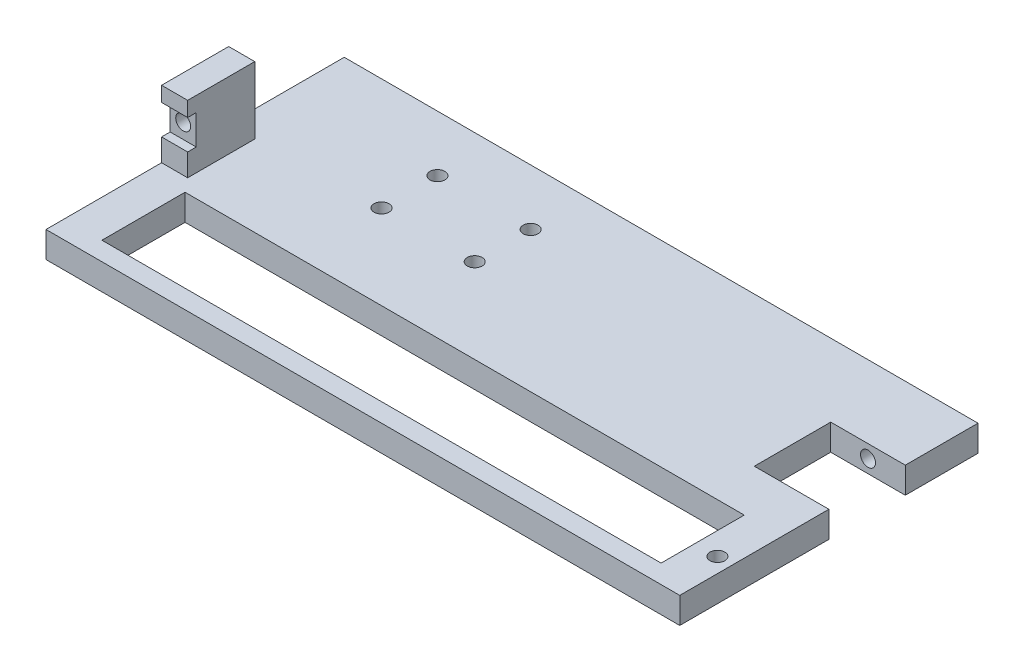
ISO-10303-21;
HEADER;
FILE_DESCRIPTION(('STEP AP214'),'2;1');
FILE_NAME('part.step','',(''),(''),'','','');
FILE_SCHEMA(('AUTOMOTIVE_DESIGN { 1 0 10303 214 1 1 1 1 }'));
ENDSEC;
DATA;
#1=APPLICATION_CONTEXT('core data for automotive mechanical design processes');
#2=APPLICATION_PROTOCOL_DEFINITION('international standard','automotive_design',2000,#1);
#3=PRODUCT_CONTEXT('',#1,'mechanical');
#4=PRODUCT('Part','Part','',(#3));
#5=PRODUCT_RELATED_PRODUCT_CATEGORY('part','',(#4));
#6=PRODUCT_DEFINITION_FORMATION('','',#4);
#7=PRODUCT_DEFINITION_CONTEXT('part definition',#1,'design');
#8=PRODUCT_DEFINITION('design','',#6,#7);
#9=PRODUCT_DEFINITION_SHAPE('','',#8);
#10=(LENGTH_UNIT() NAMED_UNIT(*) SI_UNIT(.MILLI.,.METRE.));
#11=(NAMED_UNIT(*) PLANE_ANGLE_UNIT() SI_UNIT($,.RADIAN.));
#12=(NAMED_UNIT(*) SI_UNIT($,.STERADIAN.) SOLID_ANGLE_UNIT());
#13=UNCERTAINTY_MEASURE_WITH_UNIT(LENGTH_MEASURE(1.E-05),#10,'distance_accuracy_value','');
#14=(GEOMETRIC_REPRESENTATION_CONTEXT(3) GLOBAL_UNCERTAINTY_ASSIGNED_CONTEXT((#13)) GLOBAL_UNIT_ASSIGNED_CONTEXT((#10,
#11,#12)) REPRESENTATION_CONTEXT('',''));
#15=CARTESIAN_POINT('',(0.,0.,0.));
#16=DIRECTION('',(0.,0.,1.));
#17=DIRECTION('',(1.,0.,0.));
#18=AXIS2_PLACEMENT_3D('',#15,#16,#17);
#19=CARTESIAN_POINT('',(90.1703163017032,7.,-39.7080291970803));
#20=DIRECTION('',(-1.,0.,0.));
#21=DIRECTION('',(0.,0.,1.));
#22=AXIS2_PLACEMENT_3D('',#19,#20,#21);
#23=PLANE('',#22);
#24=DIRECTION('',(0.,0.,-1.));
#25=VECTOR('',#24,1.);
#26=CARTESIAN_POINT('',(90.1703163017032,7.,-39.7080291970803));
#27=LINE('',#26,#25);
#28=CARTESIAN_POINT('',(90.1703163017032,7.,-20.2080291970803));
#29=VERTEX_POINT('',#28);
#30=CARTESIAN_POINT('',(90.1703163017032,7.,-39.7080291970803));
#31=VERTEX_POINT('',#30);
#32=EDGE_CURVE('E289',#29,#31,#27,.T.);
#33=ORIENTED_EDGE('',*,*,#32,.F.);
#34=DIRECTION('',(0.,1.,0.));
#35=VECTOR('',#34,1.);
#36=CARTESIAN_POINT('',(90.1703163017032,-4.,-20.2080291970803));
#37=LINE('',#36,#35);
#38=CARTESIAN_POINT('',(90.1703163017032,0.,-20.2080291970803));
#39=VERTEX_POINT('',#38);
#40=EDGE_CURVE('E201',#39,#29,#37,.T.);
#41=ORIENTED_EDGE('',*,*,#40,.F.);
#42=DIRECTION('',(0.,0.,-1.));
#43=VECTOR('',#42,1.);
#44=CARTESIAN_POINT('',(90.1703163017032,0.,-39.7080291970803));
#45=LINE('',#44,#43);
#46=CARTESIAN_POINT('',(90.1703163017032,0.,-39.7080291970803));
#47=VERTEX_POINT('',#46);
#48=EDGE_CURVE('E298',#39,#47,#45,.T.);
#49=ORIENTED_EDGE('',*,*,#48,.T.);
#50=DIRECTION('',(0.,-1.,0.));
#51=VECTOR('',#50,1.);
#52=CARTESIAN_POINT('',(90.1703163017032,7.,-39.7080291970803));
#53=LINE('',#52,#51);
#54=EDGE_CURVE('E306',#31,#47,#53,.T.);
#55=ORIENTED_EDGE('',*,*,#54,.F.);
#56=EDGE_LOOP('',(#33,#41,#49,#55));
#57=FACE_BOUND('',#56,.T.);
#58=ADVANCED_FACE('F32',(#57),#23,.F.);
#59=CARTESIAN_POINT('',(-79.8296836982968,25.,9.29197080291969));
#60=DIRECTION('',(0.,0.,-1.));
#61=DIRECTION('',(-1.,0.,0.));
#62=AXIS2_PLACEMENT_3D('',#59,#60,#61);
#63=PLANE('',#62);
#64=DIRECTION('',(0.,-1.,0.));
#65=VECTOR('',#64,1.);
#66=CARTESIAN_POINT('',(-79.8296836982968,25.,9.29197080291969));
#67=LINE('',#66,#65);
#68=CARTESIAN_POINT('',(-79.8296836982968,25.,9.29197080291969));
#69=VERTEX_POINT('',#68);
#70=CARTESIAN_POINT('',(-79.8296836982968,21.,9.29197080291969));
#71=VERTEX_POINT('',#70);
#72=EDGE_CURVE('E280',#69,#71,#67,.T.);
#73=ORIENTED_EDGE('',*,*,#72,.T.);
#74=DIRECTION('',(-1.,0.,0.));
#75=VECTOR('',#74,1.);
#76=CARTESIAN_POINT('',(-79.8296836982968,21.,9.29197080291969));
#77=LINE('',#76,#75);
#78=CARTESIAN_POINT('',(-72.8296836982968,21.,9.29197080291969));
#79=VERTEX_POINT('',#78);
#80=EDGE_CURVE('E228',#79,#71,#77,.T.);
#81=ORIENTED_EDGE('',*,*,#80,.F.);
#82=DIRECTION('',(0.,-1.,0.));
#83=VECTOR('',#82,1.);
#84=CARTESIAN_POINT('',(-72.8296836982968,25.,9.29197080291969));
#85=LINE('',#84,#83);
#86=CARTESIAN_POINT('',(-72.8296836982968,25.,9.29197080291969));
#87=VERTEX_POINT('',#86);
#88=EDGE_CURVE('E276',#87,#79,#85,.T.);
#89=ORIENTED_EDGE('',*,*,#88,.F.);
#90=DIRECTION('',(1.,0.,0.));
#91=VECTOR('',#90,1.);
#92=CARTESIAN_POINT('',(-79.8296836982968,25.,9.29197080291969));
#93=LINE('',#92,#91);
#94=EDGE_CURVE('E255',#69,#87,#93,.T.);
#95=ORIENTED_EDGE('',*,*,#94,.F.);
#96=EDGE_LOOP('',(#73,#81,#89,#95));
#97=FACE_BOUND('',#96,.T.);
#98=ADVANCED_FACE('F410',(#97),#63,.F.);
#99=CARTESIAN_POINT('',(-76.3296836982968,17.,11.2919708029197));
#100=DIRECTION('',(0.,0.,-1.));
#101=DIRECTION('',(-1.,0.,0.));
#102=AXIS2_PLACEMENT_3D('',#99,#100,#101);
#103=CYLINDRICAL_SURFACE('',#102,2.);
#104=CARTESIAN_POINT('',(-76.3296836982968,17.,-8.70802919708031));
#105=DIRECTION('',(0.,0.,-1.));
#106=DIRECTION('',(-1.,0.,0.));
#107=AXIS2_PLACEMENT_3D('',#104,#105,#106);
#108=CIRCLE('',#107,2.);
#109=CARTESIAN_POINT('',(-78.3296836982968,17.,-8.70802919708031));
#110=VERTEX_POINT('',#109);
#111=EDGE_CURVE('E248',#110,#110,#108,.T.);
#112=ORIENTED_EDGE('',*,*,#111,.T.);
#113=EDGE_LOOP('',(#112));
#114=FACE_BOUND('',#113,.T.);
#115=CARTESIAN_POINT('',(-76.3296836982968,17.,6.99197080291969));
#116=DIRECTION('',(0.,0.,1.));
#117=DIRECTION('',(1.,0.,0.));
#118=AXIS2_PLACEMENT_3D('',#115,#116,#117);
#119=CIRCLE('',#118,2.);
#120=CARTESIAN_POINT('',(-74.3296836982968,17.,6.99197080291969));
#121=VERTEX_POINT('',#120);
#122=EDGE_CURVE('E241',#121,#121,#119,.F.);
#123=ORIENTED_EDGE('',*,*,#122,.F.);
#124=EDGE_LOOP('',(#123));
#125=FACE_BOUND('',#124,.T.);
#126=ADVANCED_FACE('F416',(#114,#125),#103,.F.);
#127=CARTESIAN_POINT('',(-79.8296836982968,7.,-39.7080291970803));
#128=DIRECTION('',(1.,0.,0.));
#129=DIRECTION('',(0.,0.,-1.));
#130=AXIS2_PLACEMENT_3D('',#127,#128,#129);
#131=PLANE('',#130);
#132=DIRECTION('',(0.,-1.,0.));
#133=VECTOR('',#132,1.);
#134=CARTESIAN_POINT('',(-79.8296836982968,21.,6.99197080291969));
#135=LINE('',#134,#133);
#136=CARTESIAN_POINT('',(-79.8296836982968,21.,6.99197080291969));
#137=VERTEX_POINT('',#136);
#138=CARTESIAN_POINT('',(-79.8296836982968,13.,6.99197080291969));
#139=VERTEX_POINT('',#138);
#140=EDGE_CURVE('E224',#137,#139,#135,.T.);
#141=ORIENTED_EDGE('',*,*,#140,.F.);
#142=DIRECTION('',(0.,0.,1.));
#143=VECTOR('',#142,1.);
#144=CARTESIAN_POINT('',(-79.8296836982968,21.,6.99197080291969));
#145=LINE('',#144,#143);
#146=EDGE_CURVE('E238',#137,#71,#145,.T.);
#147=ORIENTED_EDGE('',*,*,#146,.T.);
#148=ORIENTED_EDGE('',*,*,#72,.F.);
#149=DIRECTION('',(0.,0.,1.));
#150=VECTOR('',#149,1.);
#151=CARTESIAN_POINT('',(-79.8296836982968,25.,-8.70802919708031));
#152=LINE('',#151,#150);
#153=CARTESIAN_POINT('',(-79.8296836982968,25.,-8.70802919708031));
#154=VERTEX_POINT('',#153);
#155=EDGE_CURVE('E252',#154,#69,#152,.T.);
#156=ORIENTED_EDGE('',*,*,#155,.F.);
#157=DIRECTION('',(0.,-1.,0.));
#158=VECTOR('',#157,1.);
#159=CARTESIAN_POINT('',(-79.8296836982968,25.,-8.70802919708031));
#160=LINE('',#159,#158);
#161=CARTESIAN_POINT('',(-79.8296836982968,7.,-8.70802919708031));
#162=VERTEX_POINT('',#161);
#163=EDGE_CURVE('E262',#154,#162,#160,.T.);
#164=ORIENTED_EDGE('',*,*,#163,.T.);
#165=DIRECTION('',(0.,0.,1.));
#166=VECTOR('',#165,1.);
#167=CARTESIAN_POINT('',(-79.8296836982968,7.,-39.7080291970803));
#168=LINE('',#167,#166);
#169=CARTESIAN_POINT('',(-79.8296836982968,7.,-39.7080291970803));
#170=VERTEX_POINT('',#169);
#171=EDGE_CURVE('E284',#170,#162,#168,.T.);
#172=ORIENTED_EDGE('',*,*,#171,.F.);
#173=DIRECTION('',(0.,-1.,0.));
#174=VECTOR('',#173,1.);
#175=CARTESIAN_POINT('',(-79.8296836982968,7.,-39.7080291970803));
#176=LINE('',#175,#174);
#177=CARTESIAN_POINT('',(-79.8296836982968,0.,-39.7080291970803));
#178=VERTEX_POINT('',#177);
#179=EDGE_CURVE('E293',#170,#178,#176,.T.);
#180=ORIENTED_EDGE('',*,*,#179,.T.);
#181=DIRECTION('',(0.,0.,1.));
#182=VECTOR('',#181,1.);
#183=CARTESIAN_POINT('',(-79.8296836982968,0.,-39.7080291970803));
#184=LINE('',#183,#182);
#185=CARTESIAN_POINT('',(-79.8296836982968,0.,40.2919708029197));
#186=VERTEX_POINT('',#185);
#187=EDGE_CURVE('E283',#178,#186,#184,.T.);
#188=ORIENTED_EDGE('',*,*,#187,.T.);
#189=DIRECTION('',(0.,-1.,0.));
#190=VECTOR('',#189,1.);
#191=CARTESIAN_POINT('',(-79.8296836982968,7.,40.2919708029197));
#192=LINE('',#191,#190);
#193=CARTESIAN_POINT('',(-79.8296836982968,7.,40.2919708029197));
#194=VERTEX_POINT('',#193);
#195=EDGE_CURVE('E312',#194,#186,#192,.T.);
#196=ORIENTED_EDGE('',*,*,#195,.F.);
#197=CARTESIAN_POINT('',(-79.8296836982968,7.,9.29197080291969));
#198=VERTEX_POINT('',#197);
#199=EDGE_CURVE('E287',#198,#194,#168,.T.);
#200=ORIENTED_EDGE('',*,*,#199,.F.);
#201=CARTESIAN_POINT('',(-79.8296836982968,13.,9.29197080291969));
#202=VERTEX_POINT('',#201);
#203=EDGE_CURVE('E279',#202,#198,#67,.T.);
#204=ORIENTED_EDGE('',*,*,#203,.F.);
#205=DIRECTION('',(0.,0.,1.));
#206=VECTOR('',#205,1.);
#207=CARTESIAN_POINT('',(-79.8296836982968,13.,6.99197080291969));
#208=LINE('',#207,#206);
#209=EDGE_CURVE('E235',#139,#202,#208,.T.);
#210=ORIENTED_EDGE('',*,*,#209,.F.);
#211=EDGE_LOOP('',(#141,#147,#148,#156,#164,#172,#180,#188,#196,#200,#204,#210));
#212=FACE_BOUND('',#211,.T.);
#213=ADVANCED_FACE('F34',(#212),#131,.F.);
#214=CARTESIAN_POINT('',(-79.8296836982968,7.,40.2919708029197));
#215=DIRECTION('',(0.,0.,-1.));
#216=DIRECTION('',(-1.,0.,0.));
#217=AXIS2_PLACEMENT_3D('',#214,#215,#216);
#218=PLANE('',#217);
#219=DIRECTION('',(1.,0.,0.));
#220=VECTOR('',#219,1.);
#221=CARTESIAN_POINT('',(-79.8296836982968,0.,40.2919708029197));
#222=LINE('',#221,#220);
#223=CARTESIAN_POINT('',(90.1703163017032,0.,40.2919708029197));
#224=VERTEX_POINT('',#223);
#225=EDGE_CURVE('E296',#186,#224,#222,.T.);
#226=ORIENTED_EDGE('',*,*,#225,.T.);
#227=DIRECTION('',(0.,-1.,0.));
#228=VECTOR('',#227,1.);
#229=CARTESIAN_POINT('',(90.1703163017032,7.,40.2919708029197));
#230=LINE('',#229,#228);
#231=CARTESIAN_POINT('',(90.1703163017032,7.,40.2919708029197));
#232=VERTEX_POINT('',#231);
#233=EDGE_CURVE('E309',#232,#224,#230,.T.);
#234=ORIENTED_EDGE('',*,*,#233,.F.);
#235=DIRECTION('',(1.,0.,0.));
#236=VECTOR('',#235,1.);
#237=CARTESIAN_POINT('',(-79.8296836982968,7.,40.2919708029197));
#238=LINE('',#237,#236);
#239=EDGE_CURVE('E286',#194,#232,#238,.T.);
#240=ORIENTED_EDGE('',*,*,#239,.F.);
#241=ORIENTED_EDGE('',*,*,#195,.T.);
#242=EDGE_LOOP('',(#226,#234,#240,#241));
#243=FACE_BOUND('',#242,.T.);
#244=ADVANCED_FACE('F421',(#243),#218,.F.);
#245=CARTESIAN_POINT('',(90.1703163017032,0.,0.291970802919699));
#246=VERTEX_POINT('',#245);
#247=EDGE_CURVE('E299',#224,#246,#45,.T.);
#248=ORIENTED_EDGE('',*,*,#247,.T.);
#249=DIRECTION('',(0.,1.,0.));
#250=VECTOR('',#249,1.);
#251=CARTESIAN_POINT('',(90.1703163017032,-4.,0.291970802919695));
#252=LINE('',#251,#250);
#253=CARTESIAN_POINT('',(90.1703163017032,7.,0.291970802919695));
#254=VERTEX_POINT('',#253);
#255=EDGE_CURVE('E49',#246,#254,#252,.T.);
#256=ORIENTED_EDGE('',*,*,#255,.T.);
#257=EDGE_CURVE('E194',#232,#254,#27,.T.);
#258=ORIENTED_EDGE('',*,*,#257,.F.);
#259=ORIENTED_EDGE('',*,*,#233,.T.);
#260=EDGE_LOOP('',(#248,#256,#258,#259));
#261=FACE_BOUND('',#260,.T.);
#262=ADVANCED_FACE('F412',(#261),#23,.F.);
#263=CARTESIAN_POINT('',(-79.8296836982968,7.,-39.7080291970803));
#264=DIRECTION('',(0.,0.,1.));
#265=DIRECTION('',(1.,0.,0.));
#266=AXIS2_PLACEMENT_3D('',#263,#264,#265);
#267=PLANE('',#266);
#268=CARTESIAN_POINT('',(80.1703163017032,3.5,-39.7080291970803));
#269=DIRECTION('',(0.,0.,1.));
#270=DIRECTION('',(1.,0.,0.));
#271=AXIS2_PLACEMENT_3D('',#268,#269,#270);
#272=CIRCLE('',#271,2.);
#273=CARTESIAN_POINT('',(82.1703163017032,3.5,-39.7080291970803));
#274=VERTEX_POINT('',#273);
#275=EDGE_CURVE('E188',#274,#274,#272,.T.);
#276=ORIENTED_EDGE('',*,*,#275,.T.);
#277=EDGE_LOOP('',(#276));
#278=FACE_BOUND('',#277,.T.);
#279=DIRECTION('',(-1.,0.,0.));
#280=VECTOR('',#279,1.);
#281=CARTESIAN_POINT('',(-79.8296836982968,0.,-39.7080291970803));
#282=LINE('',#281,#280);
#283=EDGE_CURVE('E302',#47,#178,#282,.T.);
#284=ORIENTED_EDGE('',*,*,#283,.T.);
#285=ORIENTED_EDGE('',*,*,#179,.F.);
#286=DIRECTION('',(-1.,0.,0.));
#287=VECTOR('',#286,1.);
#288=CARTESIAN_POINT('',(-79.8296836982968,7.,-39.7080291970803));
#289=LINE('',#288,#287);
#290=EDGE_CURVE('E291',#31,#170,#289,.T.);
#291=ORIENTED_EDGE('',*,*,#290,.F.);
#292=ORIENTED_EDGE('',*,*,#54,.T.);
#293=EDGE_LOOP('',(#284,#285,#291,#292));
#294=FACE_BOUND('',#293,.T.);
#295=ADVANCED_FACE('F390',(#278,#294),#267,.F.);
#296=CARTESIAN_POINT('',(0.,7.,0.));
#297=DIRECTION('',(0.,1.,0.));
#298=DIRECTION('',(0.,0.,1.));
#299=AXIS2_PLACEMENT_3D('',#296,#297,#298);
#300=PLANE('',#299);
#301=CARTESIAN_POINT('',(-14.8296836982968,7.,-9.70802919708031));
#302=DIRECTION('',(0.,1.,0.));
#303=DIRECTION('',(0.,0.,1.));
#304=AXIS2_PLACEMENT_3D('',#301,#302,#303);
#305=CIRCLE('',#304,2.);
#306=CARTESIAN_POINT('',(-14.8296836982968,7.,-7.70802919708031));
#307=VERTEX_POINT('',#306);
#308=EDGE_CURVE('E345',#307,#307,#305,.T.);
#309=ORIENTED_EDGE('',*,*,#308,.F.);
#310=EDGE_LOOP('',(#309));
#311=FACE_BOUND('',#310,.T.);
#312=CARTESIAN_POINT('',(-14.8296836982968,7.,-24.7080291970803));
#313=DIRECTION('',(0.,1.,0.));
#314=DIRECTION('',(0.,0.,1.));
#315=AXIS2_PLACEMENT_3D('',#312,#313,#314);
#316=CIRCLE('',#315,2.);
#317=CARTESIAN_POINT('',(-14.8296836982968,7.,-22.7080291970803));
#318=VERTEX_POINT('',#317);
#319=EDGE_CURVE('E348',#318,#318,#316,.T.);
#320=ORIENTED_EDGE('',*,*,#319,.F.);
#321=EDGE_LOOP('',(#320));
#322=FACE_BOUND('',#321,.T.);
#323=CARTESIAN_POINT('',(-39.8296836982968,7.,-24.7080291970803));
#324=DIRECTION('',(0.,1.,0.));
#325=DIRECTION('',(0.,0.,1.));
#326=AXIS2_PLACEMENT_3D('',#323,#324,#325);
#327=CIRCLE('',#326,2.);
#328=CARTESIAN_POINT('',(-39.8296836982968,7.,-22.7080291970803));
#329=VERTEX_POINT('',#328);
#330=EDGE_CURVE('E351',#329,#329,#327,.T.);
#331=ORIENTED_EDGE('',*,*,#330,.F.);
#332=EDGE_LOOP('',(#331));
#333=FACE_BOUND('',#332,.T.);
#334=CARTESIAN_POINT('',(-39.8296836982968,7.,-9.70802919708031));
#335=DIRECTION('',(0.,1.,0.));
#336=DIRECTION('',(0.,0.,1.));
#337=AXIS2_PLACEMENT_3D('',#334,#335,#336);
#338=CIRCLE('',#337,2.);
#339=CARTESIAN_POINT('',(-39.8296836982968,7.,-7.70802919708031));
#340=VERTEX_POINT('',#339);
#341=EDGE_CURVE('E354',#340,#340,#338,.T.);
#342=ORIENTED_EDGE('',*,*,#341,.F.);
#343=EDGE_LOOP('',(#342));
#344=FACE_BOUND('',#343,.T.);
#345=CARTESIAN_POINT('',(86.1703163017032,7.,26.1919708029197));
#346=DIRECTION('',(0.,1.,0.));
#347=DIRECTION('',(0.,0.,1.));
#348=AXIS2_PLACEMENT_3D('',#345,#346,#347);
#349=CIRCLE('',#348,2.);
#350=CARTESIAN_POINT('',(86.1703163017032,7.,28.1919708029197));
#351=VERTEX_POINT('',#350);
#352=EDGE_CURVE('E200',#351,#351,#349,.T.);
#353=ORIENTED_EDGE('',*,*,#352,.F.);
#354=EDGE_LOOP('',(#353));
#355=FACE_BOUND('',#354,.T.);
#356=DIRECTION('',(-1.,0.,0.));
#357=VECTOR('',#356,1.);
#358=CARTESIAN_POINT('',(70.1703163017032,7.,-20.2080291970803));
#359=LINE('',#358,#357);
#360=CARTESIAN_POINT('',(70.1703163017032,7.,-20.2080291970803));
#361=VERTEX_POINT('',#360);
#362=EDGE_CURVE('E178',#29,#361,#359,.T.);
#363=ORIENTED_EDGE('',*,*,#362,.F.);
#364=ORIENTED_EDGE('',*,*,#32,.T.);
#365=ORIENTED_EDGE('',*,*,#290,.T.);
#366=ORIENTED_EDGE('',*,*,#171,.T.);
#367=DIRECTION('',(-1.,0.,0.));
#368=VECTOR('',#367,1.);
#369=CARTESIAN_POINT('',(-79.8296836982968,7.,-8.70802919708031));
#370=LINE('',#369,#368);
#371=CARTESIAN_POINT('',(-72.8296836982968,7.,-8.70802919708031));
#372=VERTEX_POINT('',#371);
#373=EDGE_CURVE('E256',#372,#162,#370,.T.);
#374=ORIENTED_EDGE('',*,*,#373,.F.);
#375=DIRECTION('',(0.,0.,-1.));
#376=VECTOR('',#375,1.);
#377=CARTESIAN_POINT('',(-72.8296836982968,7.,-8.70802919708031));
#378=LINE('',#377,#376);
#379=CARTESIAN_POINT('',(-72.8296836982968,7.,9.29197080291969));
#380=VERTEX_POINT('',#379);
#381=EDGE_CURVE('E265',#380,#372,#378,.T.);
#382=ORIENTED_EDGE('',*,*,#381,.F.);
#383=DIRECTION('',(1.,0.,0.));
#384=VECTOR('',#383,1.);
#385=CARTESIAN_POINT('',(-79.8296836982968,7.,9.29197080291969));
#386=LINE('',#385,#384);
#387=EDGE_CURVE('E251',#198,#380,#386,.T.);
#388=ORIENTED_EDGE('',*,*,#387,.F.);
#389=ORIENTED_EDGE('',*,*,#199,.T.);
#390=ORIENTED_EDGE('',*,*,#239,.T.);
#391=ORIENTED_EDGE('',*,*,#257,.T.);
#392=DIRECTION('',(1.,0.,0.));
#393=VECTOR('',#392,1.);
#394=CARTESIAN_POINT('',(70.1703163017032,7.,0.291970802919695));
#395=LINE('',#394,#393);
#396=CARTESIAN_POINT('',(70.1703163017032,7.,0.291970802919695));
#397=VERTEX_POINT('',#396);
#398=EDGE_CURVE('E174',#397,#254,#395,.T.);
#399=ORIENTED_EDGE('',*,*,#398,.F.);
#400=DIRECTION('',(0.,0.,1.));
#401=VECTOR('',#400,1.);
#402=CARTESIAN_POINT('',(70.1703163017032,7.,0.291970802919695));
#403=LINE('',#402,#401);
#404=EDGE_CURVE('E181',#361,#397,#403,.T.);
#405=ORIENTED_EDGE('',*,*,#404,.F.);
#406=EDGE_LOOP('',(#363,#364,#365,#366,#374,#382,#388,#389,#390,#391,#399,#405));
#407=FACE_BOUND('',#406,.T.);
#408=DIRECTION('',(0.,0.,1.));
#409=VECTOR('',#408,1.);
#410=CARTESIAN_POINT('',(-69.8296836982968,7.,35.2919708029197));
#411=LINE('',#410,#409);
#412=CARTESIAN_POINT('',(-69.8296836982968,7.,12.9965994349697));
#413=VERTEX_POINT('',#412);
#414=CARTESIAN_POINT('',(-69.8296836982968,7.,35.2919708029197));
#415=VERTEX_POINT('',#414);
#416=EDGE_CURVE('E57',#413,#415,#411,.T.);
#417=ORIENTED_EDGE('',*,*,#416,.F.);
#418=DIRECTION('',(-1.,0.,0.));
#419=VECTOR('',#418,1.);
#420=CARTESIAN_POINT('',(-69.8296836982968,7.,12.9965994349697));
#421=LINE('',#420,#419);
#422=CARTESIAN_POINT('',(80.1703163017032,7.,12.9965994349697));
#423=VERTEX_POINT('',#422);
#424=EDGE_CURVE('E212',#423,#413,#421,.T.);
#425=ORIENTED_EDGE('',*,*,#424,.F.);
#426=DIRECTION('',(0.,0.,-1.));
#427=VECTOR('',#426,1.);
#428=CARTESIAN_POINT('',(80.1703163017032,7.,35.2919708029197));
#429=LINE('',#428,#427);
#430=CARTESIAN_POINT('',(80.1703163017032,7.,35.2919708029197));
#431=VERTEX_POINT('',#430);
#432=EDGE_CURVE('E209',#431,#423,#429,.T.);
#433=ORIENTED_EDGE('',*,*,#432,.F.);
#434=DIRECTION('',(1.,0.,0.));
#435=VECTOR('',#434,1.);
#436=CARTESIAN_POINT('',(-69.8296836982968,7.,35.2919708029197));
#437=LINE('',#436,#435);
#438=EDGE_CURVE('E205',#415,#431,#437,.T.);
#439=ORIENTED_EDGE('',*,*,#438,.F.);
#440=EDGE_LOOP('',(#417,#425,#433,#439));
#441=FACE_BOUND('',#440,.T.);
#442=ADVANCED_FACE('F191',(#311,#322,#333,#344,#355,#407,#441),#300,.T.);
#443=CARTESIAN_POINT('',(0.,0.,0.));
#444=DIRECTION('',(0.,1.,0.));
#445=DIRECTION('',(0.,0.,1.));
#446=AXIS2_PLACEMENT_3D('',#443,#444,#445);
#447=PLANE('',#446);
#448=CARTESIAN_POINT('',(-14.8296836982968,0.,-9.70802919708031));
#449=DIRECTION('',(0.,-1.,0.));
#450=DIRECTION('',(0.,0.,-1.));
#451=AXIS2_PLACEMENT_3D('',#448,#449,#450);
#452=CIRCLE('',#451,2.);
#453=CARTESIAN_POINT('',(-14.8296836982968,0.,-11.7080291970803));
#454=VERTEX_POINT('',#453);
#455=EDGE_CURVE('E361',#454,#454,#452,.T.);
#456=ORIENTED_EDGE('',*,*,#455,.F.);
#457=EDGE_LOOP('',(#456));
#458=FACE_BOUND('',#457,.T.);
#459=CARTESIAN_POINT('',(-14.8296836982968,0.,-24.7080291970803));
#460=DIRECTION('',(0.,-1.,0.));
#461=DIRECTION('',(0.,0.,-1.));
#462=AXIS2_PLACEMENT_3D('',#459,#460,#461);
#463=CIRCLE('',#462,2.);
#464=CARTESIAN_POINT('',(-14.8296836982968,0.,-26.7080291970803));
#465=VERTEX_POINT('',#464);
#466=EDGE_CURVE('E364',#465,#465,#463,.T.);
#467=ORIENTED_EDGE('',*,*,#466,.F.);
#468=EDGE_LOOP('',(#467));
#469=FACE_BOUND('',#468,.T.);
#470=CARTESIAN_POINT('',(-39.8296836982968,0.,-24.7080291970803));
#471=DIRECTION('',(0.,-1.,0.));
#472=DIRECTION('',(0.,0.,-1.));
#473=AXIS2_PLACEMENT_3D('',#470,#471,#472);
#474=CIRCLE('',#473,2.);
#475=CARTESIAN_POINT('',(-39.8296836982968,0.,-26.7080291970803));
#476=VERTEX_POINT('',#475);
#477=EDGE_CURVE('E360',#476,#476,#474,.T.);
#478=ORIENTED_EDGE('',*,*,#477,.F.);
#479=EDGE_LOOP('',(#478));
#480=FACE_BOUND('',#479,.T.);
#481=CARTESIAN_POINT('',(-39.8296836982968,0.,-9.70802919708031));
#482=DIRECTION('',(0.,-1.,0.));
#483=DIRECTION('',(0.,0.,-1.));
#484=AXIS2_PLACEMENT_3D('',#481,#482,#483);
#485=CIRCLE('',#484,2.);
#486=CARTESIAN_POINT('',(-39.8296836982968,0.,-11.7080291970803));
#487=VERTEX_POINT('',#486);
#488=EDGE_CURVE('E357',#487,#487,#485,.T.);
#489=ORIENTED_EDGE('',*,*,#488,.F.);
#490=EDGE_LOOP('',(#489));
#491=FACE_BOUND('',#490,.T.);
#492=CARTESIAN_POINT('',(86.1703163017032,0.,26.1919708029197));
#493=DIRECTION('',(0.,1.,0.));
#494=DIRECTION('',(0.,0.,1.));
#495=AXIS2_PLACEMENT_3D('',#492,#493,#494);
#496=CIRCLE('',#495,2.);
#497=CARTESIAN_POINT('',(86.1703163017032,0.,28.1919708029197));
#498=VERTEX_POINT('',#497);
#499=EDGE_CURVE('E206',#498,#498,#496,.T.);
#500=ORIENTED_EDGE('',*,*,#499,.T.);
#501=EDGE_LOOP('',(#500));
#502=FACE_BOUND('',#501,.T.);
#503=DIRECTION('',(-1.,0.,0.));
#504=VECTOR('',#503,1.);
#505=CARTESIAN_POINT('',(0.,0.,12.9965994349697));
#506=LINE('',#505,#504);
#507=CARTESIAN_POINT('',(80.1703163017032,0.,12.9965994349697));
#508=VERTEX_POINT('',#507);
#509=CARTESIAN_POINT('',(-69.8296836982968,0.,12.9965994349697));
#510=VERTEX_POINT('',#509);
#511=EDGE_CURVE('E323',#508,#510,#506,.T.);
#512=ORIENTED_EDGE('',*,*,#511,.T.);
#513=DIRECTION('',(0.,0.,1.));
#514=VECTOR('',#513,1.);
#515=CARTESIAN_POINT('',(-69.8296836982968,0.,0.));
#516=LINE('',#515,#514);
#517=CARTESIAN_POINT('',(-69.8296836982968,0.,35.2919708029197));
#518=VERTEX_POINT('',#517);
#519=EDGE_CURVE('E326',#510,#518,#516,.T.);
#520=ORIENTED_EDGE('',*,*,#519,.T.);
#521=DIRECTION('',(1.,0.,0.));
#522=VECTOR('',#521,1.);
#523=CARTESIAN_POINT('',(0.,0.,35.2919708029197));
#524=LINE('',#523,#522);
#525=CARTESIAN_POINT('',(80.1703163017032,0.,35.2919708029197));
#526=VERTEX_POINT('',#525);
#527=EDGE_CURVE('E315',#518,#526,#524,.T.);
#528=ORIENTED_EDGE('',*,*,#527,.T.);
#529=DIRECTION('',(0.,0.,-1.));
#530=VECTOR('',#529,1.);
#531=CARTESIAN_POINT('',(80.1703163017032,0.,0.));
#532=LINE('',#531,#530);
#533=EDGE_CURVE('E320',#526,#508,#532,.T.);
#534=ORIENTED_EDGE('',*,*,#533,.T.);
#535=EDGE_LOOP('',(#512,#520,#528,#534));
#536=FACE_BOUND('',#535,.T.);
#537=ORIENTED_EDGE('',*,*,#48,.F.);
#538=DIRECTION('',(-1.,0.,0.));
#539=VECTOR('',#538,1.);
#540=CARTESIAN_POINT('',(0.,0.,-20.2080291970803));
#541=LINE('',#540,#539);
#542=CARTESIAN_POINT('',(70.1703163017032,0.,-20.2080291970803));
#543=VERTEX_POINT('',#542);
#544=EDGE_CURVE('E11',#39,#543,#541,.T.);
#545=ORIENTED_EDGE('',*,*,#544,.T.);
#546=DIRECTION('',(0.,0.,1.));
#547=VECTOR('',#546,1.);
#548=CARTESIAN_POINT('',(70.1703163017032,0.,0.));
#549=LINE('',#548,#547);
#550=CARTESIAN_POINT('',(70.1703163017032,0.,0.291970802919695));
#551=VERTEX_POINT('',#550);
#552=EDGE_CURVE('E41',#543,#551,#549,.T.);
#553=ORIENTED_EDGE('',*,*,#552,.T.);
#554=DIRECTION('',(1.,0.,0.));
#555=VECTOR('',#554,1.);
#556=CARTESIAN_POINT('',(0.,0.,0.291970802919695));
#557=LINE('',#556,#555);
#558=EDGE_CURVE('E175',#551,#246,#557,.T.);
#559=ORIENTED_EDGE('',*,*,#558,.T.);
#560=ORIENTED_EDGE('',*,*,#247,.F.);
#561=ORIENTED_EDGE('',*,*,#225,.F.);
#562=ORIENTED_EDGE('',*,*,#187,.F.);
#563=ORIENTED_EDGE('',*,*,#283,.F.);
#564=EDGE_LOOP('',(#537,#545,#553,#559,#560,#561,#562,#563));
#565=FACE_BOUND('',#564,.T.);
#566=ADVANCED_FACE('F372',(#458,#469,#480,#491,#502,#536,#565),#447,.F.);
#567=CARTESIAN_POINT('',(-72.8296836982968,13.,9.29197080291969));
#568=VERTEX_POINT('',#567);
#569=EDGE_CURVE('E275',#568,#380,#85,.T.);
#570=ORIENTED_EDGE('',*,*,#569,.F.);
#571=DIRECTION('',(1.,0.,0.));
#572=VECTOR('',#571,1.);
#573=CARTESIAN_POINT('',(-79.8296836982968,13.,9.29197080291969));
#574=LINE('',#573,#572);
#575=EDGE_CURVE('E218',#202,#568,#574,.T.);
#576=ORIENTED_EDGE('',*,*,#575,.F.);
#577=ORIENTED_EDGE('',*,*,#203,.T.);
#578=ORIENTED_EDGE('',*,*,#387,.T.);
#579=EDGE_LOOP('',(#570,#576,#577,#578));
#580=FACE_BOUND('',#579,.T.);
#581=ADVANCED_FACE('F375',(#580),#63,.F.);
#582=CARTESIAN_POINT('',(-72.8296836982968,25.,-8.70802919708031));
#583=DIRECTION('',(-1.,0.,0.));
#584=DIRECTION('',(0.,0.,1.));
#585=AXIS2_PLACEMENT_3D('',#582,#583,#584);
#586=PLANE('',#585);
#587=ORIENTED_EDGE('',*,*,#88,.T.);
#588=DIRECTION('',(0.,0.,1.));
#589=VECTOR('',#588,1.);
#590=CARTESIAN_POINT('',(-72.8296836982968,21.,6.99197080291969));
#591=LINE('',#590,#589);
#592=CARTESIAN_POINT('',(-72.8296836982968,21.,6.99197080291969));
#593=VERTEX_POINT('',#592);
#594=EDGE_CURVE('E242',#593,#79,#591,.T.);
#595=ORIENTED_EDGE('',*,*,#594,.F.);
#596=DIRECTION('',(0.,1.,0.));
#597=VECTOR('',#596,1.);
#598=CARTESIAN_POINT('',(-72.8296836982968,21.,6.99197080291969));
#599=LINE('',#598,#597);
#600=CARTESIAN_POINT('',(-72.8296836982968,13.,6.99197080291969));
#601=VERTEX_POINT('',#600);
#602=EDGE_CURVE('E230',#601,#593,#599,.T.);
#603=ORIENTED_EDGE('',*,*,#602,.F.);
#604=DIRECTION('',(0.,0.,1.));
#605=VECTOR('',#604,1.);
#606=CARTESIAN_POINT('',(-72.8296836982968,13.,6.99197080291969));
#607=LINE('',#606,#605);
#608=EDGE_CURVE('E244',#601,#568,#607,.T.);
#609=ORIENTED_EDGE('',*,*,#608,.T.);
#610=ORIENTED_EDGE('',*,*,#569,.T.);
#611=ORIENTED_EDGE('',*,*,#381,.T.);
#612=DIRECTION('',(0.,-1.,0.));
#613=VECTOR('',#612,1.);
#614=CARTESIAN_POINT('',(-72.8296836982968,25.,-8.70802919708031));
#615=LINE('',#614,#613);
#616=CARTESIAN_POINT('',(-72.8296836982968,25.,-8.70802919708031));
#617=VERTEX_POINT('',#616);
#618=EDGE_CURVE('E272',#617,#372,#615,.T.);
#619=ORIENTED_EDGE('',*,*,#618,.F.);
#620=DIRECTION('',(0.,0.,-1.));
#621=VECTOR('',#620,1.);
#622=CARTESIAN_POINT('',(-72.8296836982968,25.,-8.70802919708031));
#623=LINE('',#622,#621);
#624=EDGE_CURVE('E258',#87,#617,#623,.T.);
#625=ORIENTED_EDGE('',*,*,#624,.F.);
#626=EDGE_LOOP('',(#587,#595,#603,#609,#610,#611,#619,#625));
#627=FACE_BOUND('',#626,.T.);
#628=ADVANCED_FACE('F446',(#627),#586,.F.);
#629=CARTESIAN_POINT('',(-79.8296836982968,25.,-8.70802919708031));
#630=DIRECTION('',(0.,0.,1.));
#631=DIRECTION('',(1.,0.,0.));
#632=AXIS2_PLACEMENT_3D('',#629,#630,#631);
#633=PLANE('',#632);
#634=ORIENTED_EDGE('',*,*,#111,.F.);
#635=EDGE_LOOP('',(#634));
#636=FACE_BOUND('',#635,.T.);
#637=ORIENTED_EDGE('',*,*,#373,.T.);
#638=ORIENTED_EDGE('',*,*,#163,.F.);
#639=DIRECTION('',(-1.,0.,0.));
#640=VECTOR('',#639,1.);
#641=CARTESIAN_POINT('',(-79.8296836982968,25.,-8.70802919708031));
#642=LINE('',#641,#640);
#643=EDGE_CURVE('E260',#617,#154,#642,.T.);
#644=ORIENTED_EDGE('',*,*,#643,.F.);
#645=ORIENTED_EDGE('',*,*,#618,.T.);
#646=EDGE_LOOP('',(#637,#638,#644,#645));
#647=FACE_BOUND('',#646,.T.);
#648=ADVANCED_FACE('F441',(#636,#647),#633,.F.);
#649=CARTESIAN_POINT('',(0.,25.,0.));
#650=DIRECTION('',(0.,1.,0.));
#651=DIRECTION('',(0.,0.,1.));
#652=AXIS2_PLACEMENT_3D('',#649,#650,#651);
#653=PLANE('',#652);
#654=ORIENTED_EDGE('',*,*,#155,.T.);
#655=ORIENTED_EDGE('',*,*,#94,.T.);
#656=ORIENTED_EDGE('',*,*,#624,.T.);
#657=ORIENTED_EDGE('',*,*,#643,.T.);
#658=EDGE_LOOP('',(#654,#655,#656,#657));
#659=FACE_BOUND('',#658,.T.);
#660=ADVANCED_FACE('F467',(#659),#653,.T.);
#661=CARTESIAN_POINT('',(0.,0.,6.99197080291969));
#662=DIRECTION('',(0.,0.,1.));
#663=DIRECTION('',(1.,0.,0.));
#664=AXIS2_PLACEMENT_3D('',#661,#662,#663);
#665=PLANE('',#664);
#666=ORIENTED_EDGE('',*,*,#140,.T.);
#667=DIRECTION('',(1.,0.,0.));
#668=VECTOR('',#667,1.);
#669=CARTESIAN_POINT('',(-79.8296836982968,13.,6.99197080291969));
#670=LINE('',#669,#668);
#671=EDGE_CURVE('E227',#139,#601,#670,.T.);
#672=ORIENTED_EDGE('',*,*,#671,.T.);
#673=ORIENTED_EDGE('',*,*,#602,.T.);
#674=DIRECTION('',(-1.,0.,0.));
#675=VECTOR('',#674,1.);
#676=CARTESIAN_POINT('',(-79.8296836982968,21.,6.99197080291969));
#677=LINE('',#676,#675);
#678=EDGE_CURVE('E232',#593,#137,#677,.T.);
#679=ORIENTED_EDGE('',*,*,#678,.T.);
#680=EDGE_LOOP('',(#666,#672,#673,#679));
#681=FACE_BOUND('',#680,.T.);
#682=ORIENTED_EDGE('',*,*,#122,.T.);
#683=EDGE_LOOP('',(#682));
#684=FACE_BOUND('',#683,.T.);
#685=ADVANCED_FACE('F458',(#681,#684),#665,.T.);
#686=CARTESIAN_POINT('',(-79.8296836982968,21.,6.99197080291969));
#687=DIRECTION('',(0.,1.,0.));
#688=DIRECTION('',(0.,0.,1.));
#689=AXIS2_PLACEMENT_3D('',#686,#687,#688);
#690=PLANE('',#689);
#691=ORIENTED_EDGE('',*,*,#80,.T.);
#692=ORIENTED_EDGE('',*,*,#146,.F.);
#693=ORIENTED_EDGE('',*,*,#678,.F.);
#694=ORIENTED_EDGE('',*,*,#594,.T.);
#695=EDGE_LOOP('',(#691,#692,#693,#694));
#696=FACE_BOUND('',#695,.T.);
#697=ADVANCED_FACE('F463',(#696),#690,.F.);
#698=CARTESIAN_POINT('',(-79.8296836982968,13.,6.99197080291969));
#699=DIRECTION('',(0.,-1.,0.));
#700=DIRECTION('',(0.,0.,-1.));
#701=AXIS2_PLACEMENT_3D('',#698,#699,#700);
#702=PLANE('',#701);
#703=ORIENTED_EDGE('',*,*,#575,.T.);
#704=ORIENTED_EDGE('',*,*,#608,.F.);
#705=ORIENTED_EDGE('',*,*,#671,.F.);
#706=ORIENTED_EDGE('',*,*,#209,.T.);
#707=EDGE_LOOP('',(#703,#704,#705,#706));
#708=FACE_BOUND('',#707,.T.);
#709=ADVANCED_FACE('F456',(#708),#702,.F.);
#710=CARTESIAN_POINT('',(-69.8296836982968,-4.,35.2919708029197));
#711=DIRECTION('',(-1.,0.,0.));
#712=DIRECTION('',(0.,0.,1.));
#713=AXIS2_PLACEMENT_3D('',#710,#711,#712);
#714=PLANE('',#713);
#715=DIRECTION('',(0.,1.,0.));
#716=VECTOR('',#715,1.);
#717=CARTESIAN_POINT('',(-69.8296836982968,-4.,12.9965994349697));
#718=LINE('',#717,#716);
#719=EDGE_CURVE('E216',#510,#413,#718,.T.);
#720=ORIENTED_EDGE('',*,*,#719,.T.);
#721=ORIENTED_EDGE('',*,*,#416,.T.);
#722=DIRECTION('',(0.,1.,0.));
#723=VECTOR('',#722,1.);
#724=CARTESIAN_POINT('',(-69.8296836982968,-4.,35.2919708029197));
#725=LINE('',#724,#723);
#726=EDGE_CURVE('E215',#518,#415,#725,.T.);
#727=ORIENTED_EDGE('',*,*,#726,.F.);
#728=ORIENTED_EDGE('',*,*,#519,.F.);
#729=EDGE_LOOP('',(#720,#721,#727,#728));
#730=FACE_BOUND('',#729,.T.);
#731=ADVANCED_FACE('F689',(#730),#714,.F.);
#732=CARTESIAN_POINT('',(-69.8296836982968,-4.,12.9965994349697));
#733=DIRECTION('',(0.,0.,-1.));
#734=DIRECTION('',(-1.,0.,0.));
#735=AXIS2_PLACEMENT_3D('',#732,#733,#734);
#736=PLANE('',#735);
#737=DIRECTION('',(0.,1.,0.));
#738=VECTOR('',#737,1.);
#739=CARTESIAN_POINT('',(80.1703163017032,-4.,12.9965994349697));
#740=LINE('',#739,#738);
#741=EDGE_CURVE('E219',#508,#423,#740,.T.);
#742=ORIENTED_EDGE('',*,*,#741,.T.);
#743=ORIENTED_EDGE('',*,*,#424,.T.);
#744=ORIENTED_EDGE('',*,*,#719,.F.);
#745=ORIENTED_EDGE('',*,*,#511,.F.);
#746=EDGE_LOOP('',(#742,#743,#744,#745));
#747=FACE_BOUND('',#746,.T.);
#748=ADVANCED_FACE('F680',(#747),#736,.F.);
#749=CARTESIAN_POINT('',(80.1703163017032,-4.,35.2919708029197));
#750=DIRECTION('',(1.,0.,0.));
#751=DIRECTION('',(0.,0.,-1.));
#752=AXIS2_PLACEMENT_3D('',#749,#750,#751);
#753=PLANE('',#752);
#754=DIRECTION('',(0.,1.,0.));
#755=VECTOR('',#754,1.);
#756=CARTESIAN_POINT('',(80.1703163017032,-4.,35.2919708029197));
#757=LINE('',#756,#755);
#758=EDGE_CURVE('E221',#526,#431,#757,.T.);
#759=ORIENTED_EDGE('',*,*,#758,.T.);
#760=ORIENTED_EDGE('',*,*,#432,.T.);
#761=ORIENTED_EDGE('',*,*,#741,.F.);
#762=ORIENTED_EDGE('',*,*,#533,.F.);
#763=EDGE_LOOP('',(#759,#760,#761,#762));
#764=FACE_BOUND('',#763,.T.);
#765=ADVANCED_FACE('F671',(#764),#753,.F.);
#766=CARTESIAN_POINT('',(-69.8296836982968,-4.,35.2919708029197));
#767=DIRECTION('',(0.,0.,1.));
#768=DIRECTION('',(1.,0.,0.));
#769=AXIS2_PLACEMENT_3D('',#766,#767,#768);
#770=PLANE('',#769);
#771=ORIENTED_EDGE('',*,*,#726,.T.);
#772=ORIENTED_EDGE('',*,*,#438,.T.);
#773=ORIENTED_EDGE('',*,*,#758,.F.);
#774=ORIENTED_EDGE('',*,*,#527,.F.);
#775=EDGE_LOOP('',(#771,#772,#773,#774));
#776=FACE_BOUND('',#775,.T.);
#777=ADVANCED_FACE('F405',(#776),#770,.F.);
#778=CARTESIAN_POINT('',(70.1703163017032,-4.,0.291970802919695));
#779=DIRECTION('',(-1.,0.,0.));
#780=DIRECTION('',(0.,0.,1.));
#781=AXIS2_PLACEMENT_3D('',#778,#779,#780);
#782=PLANE('',#781);
#783=DIRECTION('',(0.,1.,0.));
#784=VECTOR('',#783,1.);
#785=CARTESIAN_POINT('',(70.1703163017032,-4.,-20.2080291970803));
#786=LINE('',#785,#784);
#787=EDGE_CURVE('E184',#543,#361,#786,.T.);
#788=ORIENTED_EDGE('',*,*,#787,.T.);
#789=ORIENTED_EDGE('',*,*,#404,.T.);
#790=DIRECTION('',(0.,1.,0.));
#791=VECTOR('',#790,1.);
#792=CARTESIAN_POINT('',(70.1703163017032,-4.,0.291970802919695));
#793=LINE('',#792,#791);
#794=EDGE_CURVE('E170',#551,#397,#793,.T.);
#795=ORIENTED_EDGE('',*,*,#794,.F.);
#796=ORIENTED_EDGE('',*,*,#552,.F.);
#797=EDGE_LOOP('',(#788,#789,#795,#796));
#798=FACE_BOUND('',#797,.T.);
#799=ADVANCED_FACE('F182',(#798),#782,.F.);
#800=CARTESIAN_POINT('',(70.1703163017032,-4.,-20.2080291970803));
#801=DIRECTION('',(0.,0.,-1.));
#802=DIRECTION('',(-1.,0.,0.));
#803=AXIS2_PLACEMENT_3D('',#800,#801,#802);
#804=PLANE('',#803);
#805=CARTESIAN_POINT('',(80.1703163017032,3.5,-20.2080291970803));
#806=DIRECTION('',(0.,0.,1.));
#807=DIRECTION('',(1.,0.,0.));
#808=AXIS2_PLACEMENT_3D('',#805,#806,#807);
#809=CIRCLE('',#808,2.);
#810=CARTESIAN_POINT('',(82.1703163017032,3.5,-20.2080291970803));
#811=VERTEX_POINT('',#810);
#812=EDGE_CURVE('E339',#811,#811,#809,.T.);
#813=ORIENTED_EDGE('',*,*,#812,.F.);
#814=EDGE_LOOP('',(#813));
#815=FACE_BOUND('',#814,.T.);
#816=ORIENTED_EDGE('',*,*,#40,.T.);
#817=ORIENTED_EDGE('',*,*,#362,.T.);
#818=ORIENTED_EDGE('',*,*,#787,.F.);
#819=ORIENTED_EDGE('',*,*,#544,.F.);
#820=EDGE_LOOP('',(#816,#817,#818,#819));
#821=FACE_BOUND('',#820,.T.);
#822=ADVANCED_FACE('F394',(#815,#821),#804,.F.);
#823=CARTESIAN_POINT('',(70.1703163017032,-4.,0.291970802919695));
#824=DIRECTION('',(0.,0.,1.));
#825=DIRECTION('',(1.,0.,0.));
#826=AXIS2_PLACEMENT_3D('',#823,#824,#825);
#827=PLANE('',#826);
#828=CARTESIAN_POINT('',(80.1703163017032,3.5,0.291970802919695));
#829=DIRECTION('',(0.,0.,1.));
#830=DIRECTION('',(1.,0.,0.));
#831=AXIS2_PLACEMENT_3D('',#828,#829,#830);
#832=CIRCLE('',#831,2.);
#833=CARTESIAN_POINT('',(82.1703163017032,3.5,0.291970802919695));
#834=VERTEX_POINT('',#833);
#835=EDGE_CURVE('E36',#834,#834,#832,.F.);
#836=ORIENTED_EDGE('',*,*,#835,.F.);
#837=EDGE_LOOP('',(#836));
#838=FACE_BOUND('',#837,.T.);
#839=ORIENTED_EDGE('',*,*,#794,.T.);
#840=ORIENTED_EDGE('',*,*,#398,.T.);
#841=ORIENTED_EDGE('',*,*,#255,.F.);
#842=ORIENTED_EDGE('',*,*,#558,.F.);
#843=EDGE_LOOP('',(#839,#840,#841,#842));
#844=FACE_BOUND('',#843,.T.);
#845=ADVANCED_FACE('F172',(#838,#844),#827,.F.);
#846=CARTESIAN_POINT('',(86.1703163017032,-4.,26.1919708029197));
#847=DIRECTION('',(0.,1.,0.));
#848=DIRECTION('',(0.,0.,1.));
#849=AXIS2_PLACEMENT_3D('',#846,#847,#848);
#850=CYLINDRICAL_SURFACE('',#849,2.);
#851=ORIENTED_EDGE('',*,*,#352,.T.);
#852=EDGE_LOOP('',(#851));
#853=FACE_BOUND('',#852,.T.);
#854=ORIENTED_EDGE('',*,*,#499,.F.);
#855=EDGE_LOOP('',(#854));
#856=FACE_BOUND('',#855,.T.);
#857=ADVANCED_FACE('F402',(#853,#856),#850,.F.);
#858=CARTESIAN_POINT('',(80.1703163017032,3.5,-45.2080291970803));
#859=DIRECTION('',(0.,0.,1.));
#860=DIRECTION('',(1.,0.,0.));
#861=AXIS2_PLACEMENT_3D('',#858,#859,#860);
#862=CYLINDRICAL_SURFACE('',#861,2.);
#863=ORIENTED_EDGE('',*,*,#812,.T.);
#864=EDGE_LOOP('',(#863));
#865=FACE_BOUND('',#864,.T.);
#866=ORIENTED_EDGE('',*,*,#275,.F.);
#867=EDGE_LOOP('',(#866));
#868=FACE_BOUND('',#867,.T.);
#869=ADVANCED_FACE('F517',(#865,#868),#862,.F.);
#870=CARTESIAN_POINT('',(80.1703163017032,3.5,4.7919708029197));
#871=DIRECTION('',(0.,0.,-1.));
#872=DIRECTION('',(-1.,0.,0.));
#873=AXIS2_PLACEMENT_3D('',#870,#871,#872);
#874=CYLINDRICAL_SURFACE('',#873,2.);
#875=CARTESIAN_POINT('',(80.1703163017032,3.5,4.7919708029197));
#876=DIRECTION('',(0.,0.,1.));
#877=DIRECTION('',(1.,0.,0.));
#878=AXIS2_PLACEMENT_3D('',#875,#876,#877);
#879=CIRCLE('',#878,2.);
#880=CARTESIAN_POINT('',(82.1703163017032,3.5,4.7919708029197));
#881=VERTEX_POINT('',#880);
#882=EDGE_CURVE('E342',#881,#881,#879,.T.);
#883=ORIENTED_EDGE('',*,*,#882,.T.);
#884=EDGE_LOOP('',(#883));
#885=FACE_BOUND('',#884,.T.);
#886=ORIENTED_EDGE('',*,*,#835,.T.);
#887=EDGE_LOOP('',(#886));
#888=FACE_BOUND('',#887,.T.);
#889=ADVANCED_FACE('F508',(#885,#888),#874,.F.);
#890=CARTESIAN_POINT('',(80.1703163017032,3.5,4.7919708029197));
#891=DIRECTION('',(0.,0.,1.));
#892=DIRECTION('',(1.,0.,0.));
#893=AXIS2_PLACEMENT_3D('',#890,#891,#892);
#894=PLANE('',#893);
#895=ORIENTED_EDGE('',*,*,#882,.F.);
#896=EDGE_LOOP('',(#895));
#897=FACE_BOUND('',#896,.T.);
#898=ADVANCED_FACE('F499',(#897),#894,.F.);
#899=CARTESIAN_POINT('',(-39.8296836982968,10.,-9.70802919708031));
#900=DIRECTION('',(0.,-1.,0.));
#901=DIRECTION('',(0.,0.,-1.));
#902=AXIS2_PLACEMENT_3D('',#899,#900,#901);
#903=CYLINDRICAL_SURFACE('',#902,2.);
#904=ORIENTED_EDGE('',*,*,#341,.T.);
#905=EDGE_LOOP('',(#904));
#906=FACE_BOUND('',#905,.T.);
#907=ORIENTED_EDGE('',*,*,#488,.T.);
#908=EDGE_LOOP('',(#907));
#909=FACE_BOUND('',#908,.T.);
#910=ADVANCED_FACE('F496',(#906,#909),#903,.F.);
#911=CARTESIAN_POINT('',(-39.8296836982968,10.,-24.7080291970803));
#912=DIRECTION('',(0.,-1.,0.));
#913=DIRECTION('',(0.,0.,-1.));
#914=AXIS2_PLACEMENT_3D('',#911,#912,#913);
#915=CYLINDRICAL_SURFACE('',#914,2.);
#916=ORIENTED_EDGE('',*,*,#330,.T.);
#917=EDGE_LOOP('',(#916));
#918=FACE_BOUND('',#917,.T.);
#919=ORIENTED_EDGE('',*,*,#477,.T.);
#920=EDGE_LOOP('',(#919));
#921=FACE_BOUND('',#920,.T.);
#922=ADVANCED_FACE('F370',(#918,#921),#915,.F.);
#923=CARTESIAN_POINT('',(-14.8296836982968,10.,-24.7080291970803));
#924=DIRECTION('',(0.,-1.,0.));
#925=DIRECTION('',(0.,0.,-1.));
#926=AXIS2_PLACEMENT_3D('',#923,#924,#925);
#927=CYLINDRICAL_SURFACE('',#926,2.);
#928=ORIENTED_EDGE('',*,*,#319,.T.);
#929=EDGE_LOOP('',(#928));
#930=FACE_BOUND('',#929,.T.);
#931=ORIENTED_EDGE('',*,*,#466,.T.);
#932=EDGE_LOOP('',(#931));
#933=FACE_BOUND('',#932,.T.);
#934=ADVANCED_FACE('F505',(#930,#933),#927,.F.);
#935=CARTESIAN_POINT('',(-14.8296836982968,10.,-9.70802919708031));
#936=DIRECTION('',(0.,-1.,0.));
#937=DIRECTION('',(0.,0.,-1.));
#938=AXIS2_PLACEMENT_3D('',#935,#936,#937);
#939=CYLINDRICAL_SURFACE('',#938,2.);
#940=ORIENTED_EDGE('',*,*,#308,.T.);
#941=EDGE_LOOP('',(#940));
#942=FACE_BOUND('',#941,.T.);
#943=ORIENTED_EDGE('',*,*,#455,.T.);
#944=EDGE_LOOP('',(#943));
#945=FACE_BOUND('',#944,.T.);
#946=ADVANCED_FACE('F512',(#942,#945),#939,.F.);
#947=CLOSED_SHELL('',(#58,#98,#126,#213,#244,#262,#295,#442,#566,#581,#628,#648,#660,#685,#697,
#709,#731,#748,#765,#777,#799,#822,#845,#857,#869,#889,#898,#910,#922,#934,#946));
#948=MANIFOLD_SOLID_BREP('B2',#947);
#949=ADVANCED_BREP_SHAPE_REPRESENTATION('',(#18,#948),#14);
#950=SHAPE_DEFINITION_REPRESENTATION(#9,#949);
ENDSEC;
END-ISO-10303-21;
